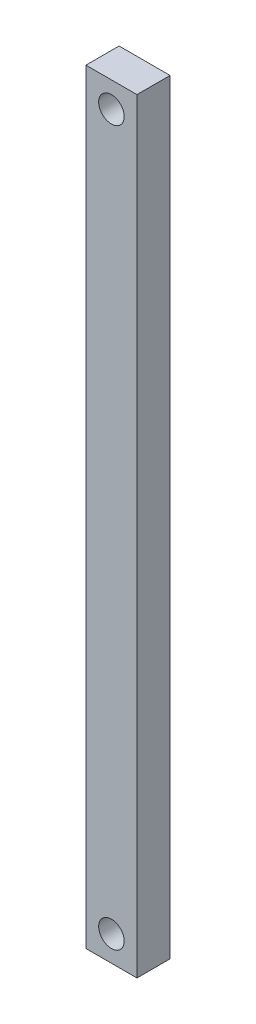
ISO-10303-21;
HEADER;
FILE_DESCRIPTION(('STEP AP214'),'2;1');
FILE_NAME('part.step','',(''),(''),'','','');
FILE_SCHEMA(('AUTOMOTIVE_DESIGN { 1 0 10303 214 1 1 1 1 }'));
ENDSEC;
DATA;
#1=APPLICATION_CONTEXT('core data for automotive mechanical design processes');
#2=APPLICATION_PROTOCOL_DEFINITION('international standard','automotive_design',2000,#1);
#3=PRODUCT_CONTEXT('',#1,'mechanical');
#4=PRODUCT('Part','Part','',(#3));
#5=PRODUCT_RELATED_PRODUCT_CATEGORY('part','',(#4));
#6=PRODUCT_DEFINITION_FORMATION('','',#4);
#7=PRODUCT_DEFINITION_CONTEXT('part definition',#1,'design');
#8=PRODUCT_DEFINITION('design','',#6,#7);
#9=PRODUCT_DEFINITION_SHAPE('','',#8);
#10=(LENGTH_UNIT() NAMED_UNIT(*) SI_UNIT(.MILLI.,.METRE.));
#11=(NAMED_UNIT(*) PLANE_ANGLE_UNIT() SI_UNIT($,.RADIAN.));
#12=(NAMED_UNIT(*) SI_UNIT($,.STERADIAN.) SOLID_ANGLE_UNIT());
#13=UNCERTAINTY_MEASURE_WITH_UNIT(LENGTH_MEASURE(1.E-05),#10,'distance_accuracy_value','');
#14=(GEOMETRIC_REPRESENTATION_CONTEXT(3) GLOBAL_UNCERTAINTY_ASSIGNED_CONTEXT((#13)) GLOBAL_UNIT_ASSIGNED_CONTEXT((#10,
#11,#12)) REPRESENTATION_CONTEXT('',''));
#15=CARTESIAN_POINT('',(0.,0.,0.));
#16=DIRECTION('',(0.,0.,1.));
#17=DIRECTION('',(1.,0.,0.));
#18=AXIS2_PLACEMENT_3D('',#15,#16,#17);
#19=CARTESIAN_POINT('',(0.,0.,6.5));
#20=DIRECTION('',(0.,0.,-1.));
#21=DIRECTION('',(-1.,0.,0.));
#22=AXIS2_PLACEMENT_3D('',#19,#20,#21);
#23=PLANE('',#22);
#24=DIRECTION('',(0.,-1.,0.));
#25=VECTOR('',#24,1.);
#26=CARTESIAN_POINT('',(-13.8860464194743,-122.063519429542,6.5));
#27=LINE('',#26,#25);
#28=CARTESIAN_POINT('',(-13.8860464194743,27.9364805704581,6.5));
#29=VERTEX_POINT('',#28);
#30=CARTESIAN_POINT('',(-13.8860464194743,-122.063519429542,6.5));
#31=VERTEX_POINT('',#30);
#32=EDGE_CURVE('E87',#29,#31,#27,.T.);
#33=ORIENTED_EDGE('',*,*,#32,.T.);
#34=DIRECTION('',(1.,0.,0.));
#35=VECTOR('',#34,1.);
#36=CARTESIAN_POINT('',(-3.88604641947425,-122.063519429542,6.5));
#37=LINE('',#36,#35);
#38=CARTESIAN_POINT('',(-3.88604641947425,-122.063519429542,6.5));
#39=VERTEX_POINT('',#38);
#40=EDGE_CURVE('E82',#31,#39,#37,.T.);
#41=ORIENTED_EDGE('',*,*,#40,.T.);
#42=DIRECTION('',(0.,1.,0.));
#43=VECTOR('',#42,1.);
#44=CARTESIAN_POINT('',(-3.88604641947427,27.9364805704581,6.5));
#45=LINE('',#44,#43);
#46=CARTESIAN_POINT('',(-3.88604641947427,27.9364805704581,6.5));
#47=VERTEX_POINT('',#46);
#48=EDGE_CURVE('E85',#39,#47,#45,.T.);
#49=ORIENTED_EDGE('',*,*,#48,.T.);
#50=DIRECTION('',(-1.,0.,0.));
#51=VECTOR('',#50,1.);
#52=CARTESIAN_POINT('',(-13.8860464194743,27.9364805704581,6.5));
#53=LINE('',#52,#51);
#54=EDGE_CURVE('E52',#47,#29,#53,.T.);
#55=ORIENTED_EDGE('',*,*,#54,.T.);
#56=EDGE_LOOP('',(#33,#41,#49,#55));
#57=FACE_BOUND('',#56,.T.);
#58=CARTESIAN_POINT('',(-8.88604641947427,22.9364805704581,6.5));
#59=DIRECTION('',(0.,0.,1.));
#60=DIRECTION('',(1.,0.,0.));
#61=AXIS2_PLACEMENT_3D('',#58,#59,#60);
#62=CIRCLE('',#61,2.5);
#63=CARTESIAN_POINT('',(-6.38604641947427,22.9364805704581,6.5));
#64=VERTEX_POINT('',#63);
#65=EDGE_CURVE('E102',#64,#64,#62,.T.);
#66=ORIENTED_EDGE('',*,*,#65,.F.);
#67=EDGE_LOOP('',(#66));
#68=FACE_BOUND('',#67,.T.);
#69=CARTESIAN_POINT('',(-8.88604641947427,-117.063519429542,6.5));
#70=DIRECTION('',(0.,0.,1.));
#71=DIRECTION('',(1.,0.,0.));
#72=AXIS2_PLACEMENT_3D('',#69,#70,#71);
#73=CIRCLE('',#72,2.5);
#74=CARTESIAN_POINT('',(-6.38604641947427,-117.063519429542,6.5));
#75=VERTEX_POINT('',#74);
#76=EDGE_CURVE('E117',#75,#75,#73,.T.);
#77=ORIENTED_EDGE('',*,*,#76,.F.);
#78=EDGE_LOOP('',(#77));
#79=FACE_BOUND('',#78,.T.);
#80=ADVANCED_FACE('F35',(#57,#68,#79),#23,.F.);
#81=CARTESIAN_POINT('',(0.,0.,0.));
#82=DIRECTION('',(0.,0.,-1.));
#83=DIRECTION('',(-1.,0.,0.));
#84=AXIS2_PLACEMENT_3D('',#81,#82,#83);
#85=PLANE('',#84);
#86=CARTESIAN_POINT('',(-8.88604641947427,22.9364805704581,0.));
#87=DIRECTION('',(0.,0.,1.));
#88=DIRECTION('',(1.,0.,0.));
#89=AXIS2_PLACEMENT_3D('',#86,#87,#88);
#90=CIRCLE('',#89,2.5);
#91=CARTESIAN_POINT('',(-6.38604641947427,22.9364805704581,0.));
#92=VERTEX_POINT('',#91);
#93=EDGE_CURVE('E114',#92,#92,#90,.T.);
#94=ORIENTED_EDGE('',*,*,#93,.T.);
#95=EDGE_LOOP('',(#94));
#96=FACE_BOUND('',#95,.T.);
#97=DIRECTION('',(0.,-1.,0.));
#98=VECTOR('',#97,1.);
#99=CARTESIAN_POINT('',(-13.8860464194743,-122.063519429542,0.));
#100=LINE('',#99,#98);
#101=CARTESIAN_POINT('',(-13.8860464194743,27.9364805704581,0.));
#102=VERTEX_POINT('',#101);
#103=CARTESIAN_POINT('',(-13.8860464194743,-122.063519429542,0.));
#104=VERTEX_POINT('',#103);
#105=EDGE_CURVE('E99',#102,#104,#100,.T.);
#106=ORIENTED_EDGE('',*,*,#105,.F.);
#107=DIRECTION('',(-1.,0.,0.));
#108=VECTOR('',#107,1.);
#109=CARTESIAN_POINT('',(-13.8860464194743,27.9364805704581,0.));
#110=LINE('',#109,#108);
#111=CARTESIAN_POINT('',(-3.88604641947427,27.9364805704581,0.));
#112=VERTEX_POINT('',#111);
#113=EDGE_CURVE('E75',#112,#102,#110,.T.);
#114=ORIENTED_EDGE('',*,*,#113,.F.);
#115=DIRECTION('',(0.,1.,0.));
#116=VECTOR('',#115,1.);
#117=CARTESIAN_POINT('',(-3.88604641947427,27.9364805704581,0.));
#118=LINE('',#117,#116);
#119=CARTESIAN_POINT('',(-3.88604641947425,-122.063519429542,0.));
#120=VERTEX_POINT('',#119);
#121=EDGE_CURVE('E69',#120,#112,#118,.T.);
#122=ORIENTED_EDGE('',*,*,#121,.F.);
#123=DIRECTION('',(1.,0.,0.));
#124=VECTOR('',#123,1.);
#125=CARTESIAN_POINT('',(-3.88604641947425,-122.063519429542,0.));
#126=LINE('',#125,#124);
#127=EDGE_CURVE('E91',#104,#120,#126,.T.);
#128=ORIENTED_EDGE('',*,*,#127,.F.);
#129=EDGE_LOOP('',(#106,#114,#122,#128));
#130=FACE_BOUND('',#129,.T.);
#131=CARTESIAN_POINT('',(-8.88604641947427,-117.063519429542,0.));
#132=DIRECTION('',(0.,0.,1.));
#133=DIRECTION('',(1.,0.,0.));
#134=AXIS2_PLACEMENT_3D('',#131,#132,#133);
#135=CIRCLE('',#134,2.5);
#136=CARTESIAN_POINT('',(-6.38604641947427,-117.063519429542,0.));
#137=VERTEX_POINT('',#136);
#138=EDGE_CURVE('E120',#137,#137,#135,.T.);
#139=ORIENTED_EDGE('',*,*,#138,.T.);
#140=EDGE_LOOP('',(#139));
#141=FACE_BOUND('',#140,.T.);
#142=ADVANCED_FACE('F110',(#96,#130,#141),#85,.T.);
#143=CARTESIAN_POINT('',(-13.8860464194743,-122.063519429542,6.5));
#144=DIRECTION('',(1.,0.,0.));
#145=DIRECTION('',(0.,0.,-1.));
#146=AXIS2_PLACEMENT_3D('',#143,#144,#145);
#147=PLANE('',#146);
#148=ORIENTED_EDGE('',*,*,#105,.T.);
#149=DIRECTION('',(0.,0.,-1.));
#150=VECTOR('',#149,1.);
#151=CARTESIAN_POINT('',(-13.8860464194743,-122.063519429542,6.5));
#152=LINE('',#151,#150);
#153=EDGE_CURVE('E11',#31,#104,#152,.T.);
#154=ORIENTED_EDGE('',*,*,#153,.F.);
#155=ORIENTED_EDGE('',*,*,#32,.F.);
#156=DIRECTION('',(0.,0.,-1.));
#157=VECTOR('',#156,1.);
#158=CARTESIAN_POINT('',(-13.8860464194743,27.9364805704581,6.5));
#159=LINE('',#158,#157);
#160=EDGE_CURVE('E95',#29,#102,#159,.T.);
#161=ORIENTED_EDGE('',*,*,#160,.T.);
#162=EDGE_LOOP('',(#148,#154,#155,#161));
#163=FACE_BOUND('',#162,.T.);
#164=ADVANCED_FACE('F37',(#163),#147,.F.);
#165=CARTESIAN_POINT('',(-3.88604641947425,-122.063519429542,6.5));
#166=DIRECTION('',(0.,1.,0.));
#167=DIRECTION('',(0.,0.,1.));
#168=AXIS2_PLACEMENT_3D('',#165,#166,#167);
#169=PLANE('',#168);
#170=ORIENTED_EDGE('',*,*,#127,.T.);
#171=DIRECTION('',(0.,0.,-1.));
#172=VECTOR('',#171,1.);
#173=CARTESIAN_POINT('',(-3.88604641947425,-122.063519429542,6.5));
#174=LINE('',#173,#172);
#175=EDGE_CURVE('E44',#39,#120,#174,.T.);
#176=ORIENTED_EDGE('',*,*,#175,.F.);
#177=ORIENTED_EDGE('',*,*,#40,.F.);
#178=ORIENTED_EDGE('',*,*,#153,.T.);
#179=EDGE_LOOP('',(#170,#176,#177,#178));
#180=FACE_BOUND('',#179,.T.);
#181=ADVANCED_FACE('F90',(#180),#169,.F.);
#182=CARTESIAN_POINT('',(-3.88604641947427,27.9364805704581,6.5));
#183=DIRECTION('',(-1.,0.,0.));
#184=DIRECTION('',(0.,-1.,0.));
#185=AXIS2_PLACEMENT_3D('',#182,#183,#184);
#186=PLANE('',#185);
#187=ORIENTED_EDGE('',*,*,#121,.T.);
#188=DIRECTION('',(0.,0.,-1.));
#189=VECTOR('',#188,1.);
#190=CARTESIAN_POINT('',(-3.88604641947427,27.9364805704581,6.5));
#191=LINE('',#190,#189);
#192=EDGE_CURVE('E92',#47,#112,#191,.T.);
#193=ORIENTED_EDGE('',*,*,#192,.F.);
#194=ORIENTED_EDGE('',*,*,#48,.F.);
#195=ORIENTED_EDGE('',*,*,#175,.T.);
#196=EDGE_LOOP('',(#187,#193,#194,#195));
#197=FACE_BOUND('',#196,.T.);
#198=ADVANCED_FACE('F93',(#197),#186,.F.);
#199=CARTESIAN_POINT('',(-13.8860464194743,27.9364805704581,6.5));
#200=DIRECTION('',(0.,-1.,0.));
#201=DIRECTION('',(0.,0.,-1.));
#202=AXIS2_PLACEMENT_3D('',#199,#200,#201);
#203=PLANE('',#202);
#204=ORIENTED_EDGE('',*,*,#113,.T.);
#205=ORIENTED_EDGE('',*,*,#160,.F.);
#206=ORIENTED_EDGE('',*,*,#54,.F.);
#207=ORIENTED_EDGE('',*,*,#192,.T.);
#208=EDGE_LOOP('',(#204,#205,#206,#207));
#209=FACE_BOUND('',#208,.T.);
#210=ADVANCED_FACE('F107',(#209),#203,.F.);
#211=CARTESIAN_POINT('',(-8.88604641947427,22.9364805704581,6.5));
#212=DIRECTION('',(0.,0.,-1.));
#213=DIRECTION('',(-1.,0.,0.));
#214=AXIS2_PLACEMENT_3D('',#211,#212,#213);
#215=CYLINDRICAL_SURFACE('',#214,2.5);
#216=ORIENTED_EDGE('',*,*,#65,.T.);
#217=EDGE_LOOP('',(#216));
#218=FACE_BOUND('',#217,.T.);
#219=ORIENTED_EDGE('',*,*,#93,.F.);
#220=EDGE_LOOP('',(#219));
#221=FACE_BOUND('',#220,.T.);
#222=ADVANCED_FACE('F137',(#218,#221),#215,.F.);
#223=CARTESIAN_POINT('',(-8.88604641947427,-117.063519429542,6.5));
#224=DIRECTION('',(0.,0.,-1.));
#225=DIRECTION('',(-1.,0.,0.));
#226=AXIS2_PLACEMENT_3D('',#223,#224,#225);
#227=CYLINDRICAL_SURFACE('',#226,2.5);
#228=ORIENTED_EDGE('',*,*,#76,.T.);
#229=EDGE_LOOP('',(#228));
#230=FACE_BOUND('',#229,.T.);
#231=ORIENTED_EDGE('',*,*,#138,.F.);
#232=EDGE_LOOP('',(#231));
#233=FACE_BOUND('',#232,.T.);
#234=ADVANCED_FACE('F126',(#230,#233),#227,.F.);
#235=CLOSED_SHELL('',(#80,#142,#164,#181,#198,#210,#222,#234));
#236=MANIFOLD_SOLID_BREP('B2',#235);
#237=ADVANCED_BREP_SHAPE_REPRESENTATION('',(#18,#236),#14);
#238=SHAPE_DEFINITION_REPRESENTATION(#9,#237);
ENDSEC;
END-ISO-10303-21;
